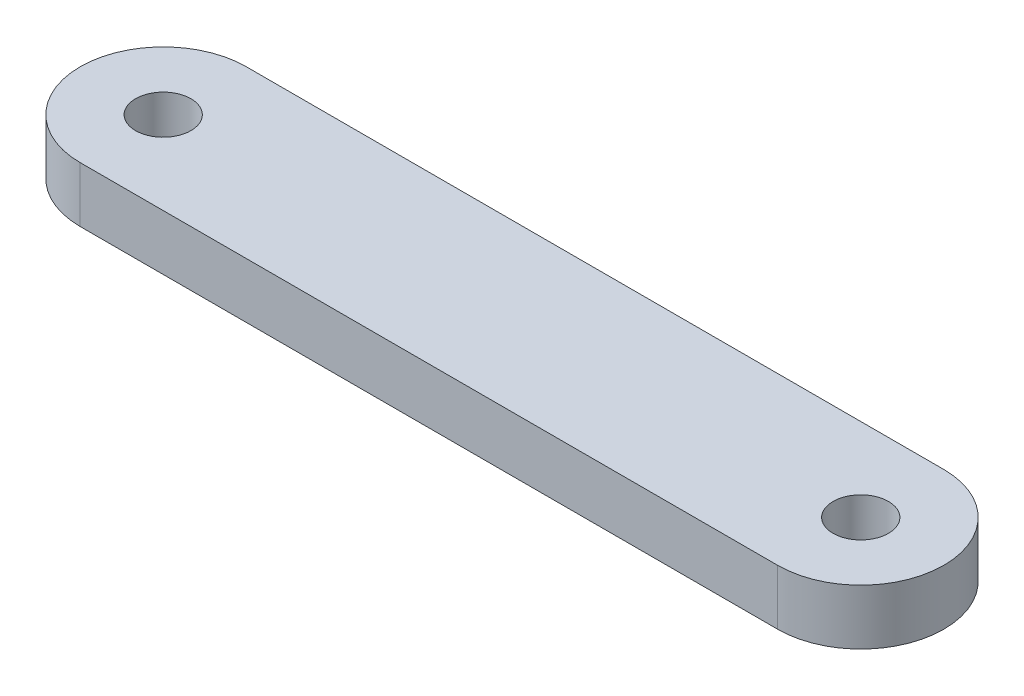
ISO-10303-21;
HEADER;
FILE_DESCRIPTION(('STEP AP214'),'2;1');
FILE_NAME('part.step','',(''),(''),'','','');
FILE_SCHEMA(('AUTOMOTIVE_DESIGN { 1 0 10303 214 1 1 1 1 }'));
ENDSEC;
DATA;
#1=APPLICATION_CONTEXT('core data for automotive mechanical design processes');
#2=APPLICATION_PROTOCOL_DEFINITION('international standard','automotive_design',2000,#1);
#3=PRODUCT_CONTEXT('',#1,'mechanical');
#4=PRODUCT('Part','Part','',(#3));
#5=PRODUCT_RELATED_PRODUCT_CATEGORY('part','',(#4));
#6=PRODUCT_DEFINITION_FORMATION('','',#4);
#7=PRODUCT_DEFINITION_CONTEXT('part definition',#1,'design');
#8=PRODUCT_DEFINITION('design','',#6,#7);
#9=PRODUCT_DEFINITION_SHAPE('','',#8);
#10=(LENGTH_UNIT() NAMED_UNIT(*) SI_UNIT(.MILLI.,.METRE.));
#11=(NAMED_UNIT(*) PLANE_ANGLE_UNIT() SI_UNIT($,.RADIAN.));
#12=(NAMED_UNIT(*) SI_UNIT($,.STERADIAN.) SOLID_ANGLE_UNIT());
#13=UNCERTAINTY_MEASURE_WITH_UNIT(LENGTH_MEASURE(1.E-05),#10,'distance_accuracy_value','');
#14=(GEOMETRIC_REPRESENTATION_CONTEXT(3) GLOBAL_UNCERTAINTY_ASSIGNED_CONTEXT((#13)) GLOBAL_UNIT_ASSIGNED_CONTEXT((#10,
#11,#12)) REPRESENTATION_CONTEXT('',''));
#15=CARTESIAN_POINT('',(0.,0.,0.));
#16=DIRECTION('',(0.,0.,1.));
#17=DIRECTION('',(1.,0.,0.));
#18=AXIS2_PLACEMENT_3D('',#15,#16,#17);
#19=CARTESIAN_POINT('',(-20.,3.175,4.7625));
#20=DIRECTION('',(0.,1.,0.));
#21=DIRECTION('',(0.,0.,1.));
#22=AXIS2_PLACEMENT_3D('',#19,#20,#21);
#23=PLANE('',#22);
#24=CARTESIAN_POINT('',(-20.,3.175,4.7625));
#25=DIRECTION('',(0.,1.,0.));
#26=DIRECTION('',(0.,0.,1.));
#27=AXIS2_PLACEMENT_3D('',#24,#25,#26);
#28=CIRCLE('',#27,1.5875);
#29=CARTESIAN_POINT('',(-20.,3.175,6.35));
#30=VERTEX_POINT('',#29);
#31=EDGE_CURVE('E102',#30,#30,#28,.T.);
#32=ORIENTED_EDGE('',*,*,#31,.F.);
#33=EDGE_LOOP('',(#32));
#34=FACE_BOUND('',#33,.T.);
#35=CARTESIAN_POINT('',(-20.,3.175,4.7625));
#36=DIRECTION('',(0.,1.,0.));
#37=DIRECTION('',(0.,0.,1.));
#38=AXIS2_PLACEMENT_3D('',#35,#36,#37);
#39=CIRCLE('',#38,4.7625);
#40=CARTESIAN_POINT('',(-20.,3.175,0.));
#41=VERTEX_POINT('',#40);
#42=CARTESIAN_POINT('',(-20.,3.175,9.525));
#43=VERTEX_POINT('',#42);
#44=EDGE_CURVE('E87',#41,#43,#39,.T.);
#45=ORIENTED_EDGE('',*,*,#44,.T.);
#46=DIRECTION('',(1.,0.,0.));
#47=VECTOR('',#46,1.);
#48=CARTESIAN_POINT('',(-20.,3.175,9.525));
#49=LINE('',#48,#47);
#50=CARTESIAN_POINT('',(20.,3.175,9.52499999999999));
#51=VERTEX_POINT('',#50);
#52=EDGE_CURVE('E82',#43,#51,#49,.T.);
#53=ORIENTED_EDGE('',*,*,#52,.T.);
#54=CARTESIAN_POINT('',(20.,3.175,4.76249999999999));
#55=DIRECTION('',(0.,1.,0.));
#56=DIRECTION('',(0.,0.,1.));
#57=AXIS2_PLACEMENT_3D('',#54,#55,#56);
#58=CIRCLE('',#57,4.7625);
#59=CARTESIAN_POINT('',(20.,3.175,0.));
#60=VERTEX_POINT('',#59);
#61=EDGE_CURVE('E85',#51,#60,#58,.T.);
#62=ORIENTED_EDGE('',*,*,#61,.T.);
#63=DIRECTION('',(-1.,0.,0.));
#64=VECTOR('',#63,1.);
#65=CARTESIAN_POINT('',(-20.,3.175,0.));
#66=LINE('',#65,#64);
#67=EDGE_CURVE('E52',#60,#41,#66,.T.);
#68=ORIENTED_EDGE('',*,*,#67,.T.);
#69=EDGE_LOOP('',(#45,#53,#62,#68));
#70=FACE_BOUND('',#69,.T.);
#71=CARTESIAN_POINT('',(20.,3.175,4.76249999999999));
#72=DIRECTION('',(0.,1.,0.));
#73=DIRECTION('',(0.,0.,1.));
#74=AXIS2_PLACEMENT_3D('',#71,#72,#73);
#75=CIRCLE('',#74,1.5875);
#76=CARTESIAN_POINT('',(20.,3.175,6.34999999999999));
#77=VERTEX_POINT('',#76);
#78=EDGE_CURVE('E117',#77,#77,#75,.T.);
#79=ORIENTED_EDGE('',*,*,#78,.F.);
#80=EDGE_LOOP('',(#79));
#81=FACE_BOUND('',#80,.T.);
#82=ADVANCED_FACE('F35',(#34,#70,#81),#23,.T.);
#83=CARTESIAN_POINT('',(-20.,0.,4.7625));
#84=DIRECTION('',(0.,1.,0.));
#85=DIRECTION('',(0.,0.,1.));
#86=AXIS2_PLACEMENT_3D('',#83,#84,#85);
#87=PLANE('',#86);
#88=CARTESIAN_POINT('',(-20.,0.,4.7625));
#89=DIRECTION('',(0.,1.,0.));
#90=DIRECTION('',(0.,0.,1.));
#91=AXIS2_PLACEMENT_3D('',#88,#89,#90);
#92=CIRCLE('',#91,1.5875);
#93=CARTESIAN_POINT('',(-20.,0.,6.35));
#94=VERTEX_POINT('',#93);
#95=EDGE_CURVE('E114',#94,#94,#92,.T.);
#96=ORIENTED_EDGE('',*,*,#95,.T.);
#97=EDGE_LOOP('',(#96));
#98=FACE_BOUND('',#97,.T.);
#99=CARTESIAN_POINT('',(-20.,0.,4.7625));
#100=DIRECTION('',(0.,1.,0.));
#101=DIRECTION('',(0.,0.,1.));
#102=AXIS2_PLACEMENT_3D('',#99,#100,#101);
#103=CIRCLE('',#102,4.7625);
#104=CARTESIAN_POINT('',(-20.,0.,0.));
#105=VERTEX_POINT('',#104);
#106=CARTESIAN_POINT('',(-20.,0.,9.525));
#107=VERTEX_POINT('',#106);
#108=EDGE_CURVE('E99',#105,#107,#103,.T.);
#109=ORIENTED_EDGE('',*,*,#108,.F.);
#110=DIRECTION('',(-1.,0.,0.));
#111=VECTOR('',#110,1.);
#112=CARTESIAN_POINT('',(-20.,0.,0.));
#113=LINE('',#112,#111);
#114=CARTESIAN_POINT('',(20.,0.,0.));
#115=VERTEX_POINT('',#114);
#116=EDGE_CURVE('E75',#115,#105,#113,.T.);
#117=ORIENTED_EDGE('',*,*,#116,.F.);
#118=CARTESIAN_POINT('',(20.,0.,4.76249999999999));
#119=DIRECTION('',(0.,1.,0.));
#120=DIRECTION('',(0.,0.,1.));
#121=AXIS2_PLACEMENT_3D('',#118,#119,#120);
#122=CIRCLE('',#121,4.7625);
#123=CARTESIAN_POINT('',(20.,0.,9.52499999999999));
#124=VERTEX_POINT('',#123);
#125=EDGE_CURVE('E69',#124,#115,#122,.T.);
#126=ORIENTED_EDGE('',*,*,#125,.F.);
#127=DIRECTION('',(1.,0.,0.));
#128=VECTOR('',#127,1.);
#129=CARTESIAN_POINT('',(-20.,0.,9.525));
#130=LINE('',#129,#128);
#131=EDGE_CURVE('E91',#107,#124,#130,.T.);
#132=ORIENTED_EDGE('',*,*,#131,.F.);
#133=EDGE_LOOP('',(#109,#117,#126,#132));
#134=FACE_BOUND('',#133,.T.);
#135=CARTESIAN_POINT('',(20.,0.,4.76249999999999));
#136=DIRECTION('',(0.,1.,0.));
#137=DIRECTION('',(0.,0.,1.));
#138=AXIS2_PLACEMENT_3D('',#135,#136,#137);
#139=CIRCLE('',#138,1.5875);
#140=CARTESIAN_POINT('',(20.,0.,6.34999999999999));
#141=VERTEX_POINT('',#140);
#142=EDGE_CURVE('E120',#141,#141,#139,.T.);
#143=ORIENTED_EDGE('',*,*,#142,.T.);
#144=EDGE_LOOP('',(#143));
#145=FACE_BOUND('',#144,.T.);
#146=ADVANCED_FACE('F110',(#98,#134,#145),#87,.F.);
#147=CARTESIAN_POINT('',(-20.,3.175,4.7625));
#148=DIRECTION('',(0.,-1.,0.));
#149=DIRECTION('',(0.,0.,-1.));
#150=AXIS2_PLACEMENT_3D('',#147,#148,#149);
#151=CYLINDRICAL_SURFACE('',#150,4.7625);
#152=ORIENTED_EDGE('',*,*,#108,.T.);
#153=DIRECTION('',(0.,-1.,0.));
#154=VECTOR('',#153,1.);
#155=CARTESIAN_POINT('',(-20.,3.175,9.525));
#156=LINE('',#155,#154);
#157=EDGE_CURVE('E11',#43,#107,#156,.T.);
#158=ORIENTED_EDGE('',*,*,#157,.F.);
#159=ORIENTED_EDGE('',*,*,#44,.F.);
#160=DIRECTION('',(0.,-1.,0.));
#161=VECTOR('',#160,1.);
#162=CARTESIAN_POINT('',(-20.,3.175,0.));
#163=LINE('',#162,#161);
#164=EDGE_CURVE('E95',#41,#105,#163,.T.);
#165=ORIENTED_EDGE('',*,*,#164,.T.);
#166=EDGE_LOOP('',(#152,#158,#159,#165));
#167=FACE_BOUND('',#166,.T.);
#168=ADVANCED_FACE('F37',(#167),#151,.T.);
#169=CARTESIAN_POINT('',(-20.,3.175,9.525));
#170=DIRECTION('',(0.,0.,-1.));
#171=DIRECTION('',(-1.,0.,0.));
#172=AXIS2_PLACEMENT_3D('',#169,#170,#171);
#173=PLANE('',#172);
#174=ORIENTED_EDGE('',*,*,#131,.T.);
#175=DIRECTION('',(0.,-1.,0.));
#176=VECTOR('',#175,1.);
#177=CARTESIAN_POINT('',(20.,3.175,9.52499999999999));
#178=LINE('',#177,#176);
#179=EDGE_CURVE('E44',#51,#124,#178,.T.);
#180=ORIENTED_EDGE('',*,*,#179,.F.);
#181=ORIENTED_EDGE('',*,*,#52,.F.);
#182=ORIENTED_EDGE('',*,*,#157,.T.);
#183=EDGE_LOOP('',(#174,#180,#181,#182));
#184=FACE_BOUND('',#183,.T.);
#185=ADVANCED_FACE('F90',(#184),#173,.F.);
#186=CARTESIAN_POINT('',(20.,3.175,4.76249999999999));
#187=DIRECTION('',(0.,-1.,0.));
#188=DIRECTION('',(0.,0.,-1.));
#189=AXIS2_PLACEMENT_3D('',#186,#187,#188);
#190=CYLINDRICAL_SURFACE('',#189,4.7625);
#191=ORIENTED_EDGE('',*,*,#125,.T.);
#192=DIRECTION('',(0.,-1.,0.));
#193=VECTOR('',#192,1.);
#194=CARTESIAN_POINT('',(20.,3.175,0.));
#195=LINE('',#194,#193);
#196=EDGE_CURVE('E92',#60,#115,#195,.T.);
#197=ORIENTED_EDGE('',*,*,#196,.F.);
#198=ORIENTED_EDGE('',*,*,#61,.F.);
#199=ORIENTED_EDGE('',*,*,#179,.T.);
#200=EDGE_LOOP('',(#191,#197,#198,#199));
#201=FACE_BOUND('',#200,.T.);
#202=ADVANCED_FACE('F93',(#201),#190,.T.);
#203=CARTESIAN_POINT('',(-20.,3.175,0.));
#204=DIRECTION('',(0.,0.,1.));
#205=DIRECTION('',(1.,0.,0.));
#206=AXIS2_PLACEMENT_3D('',#203,#204,#205);
#207=PLANE('',#206);
#208=ORIENTED_EDGE('',*,*,#116,.T.);
#209=ORIENTED_EDGE('',*,*,#164,.F.);
#210=ORIENTED_EDGE('',*,*,#67,.F.);
#211=ORIENTED_EDGE('',*,*,#196,.T.);
#212=EDGE_LOOP('',(#208,#209,#210,#211));
#213=FACE_BOUND('',#212,.T.);
#214=ADVANCED_FACE('F107',(#213),#207,.F.);
#215=CARTESIAN_POINT('',(-20.,3.175,4.7625));
#216=DIRECTION('',(0.,-1.,0.));
#217=DIRECTION('',(0.,0.,-1.));
#218=AXIS2_PLACEMENT_3D('',#215,#216,#217);
#219=CYLINDRICAL_SURFACE('',#218,1.5875);
#220=ORIENTED_EDGE('',*,*,#31,.T.);
#221=EDGE_LOOP('',(#220));
#222=FACE_BOUND('',#221,.T.);
#223=ORIENTED_EDGE('',*,*,#95,.F.);
#224=EDGE_LOOP('',(#223));
#225=FACE_BOUND('',#224,.T.);
#226=ADVANCED_FACE('F138',(#222,#225),#219,.F.);
#227=CARTESIAN_POINT('',(20.,3.175,4.76249999999999));
#228=DIRECTION('',(0.,-1.,0.));
#229=DIRECTION('',(0.,0.,-1.));
#230=AXIS2_PLACEMENT_3D('',#227,#228,#229);
#231=CYLINDRICAL_SURFACE('',#230,1.5875);
#232=ORIENTED_EDGE('',*,*,#78,.T.);
#233=EDGE_LOOP('',(#232));
#234=FACE_BOUND('',#233,.T.);
#235=ORIENTED_EDGE('',*,*,#142,.F.);
#236=EDGE_LOOP('',(#235));
#237=FACE_BOUND('',#236,.T.);
#238=ADVANCED_FACE('F126',(#234,#237),#231,.F.);
#239=CLOSED_SHELL('',(#82,#146,#168,#185,#202,#214,#226,#238));
#240=MANIFOLD_SOLID_BREP('B2',#239);
#241=ADVANCED_BREP_SHAPE_REPRESENTATION('',(#18,#240),#14);
#242=SHAPE_DEFINITION_REPRESENTATION(#9,#241);
ENDSEC;
END-ISO-10303-21;
